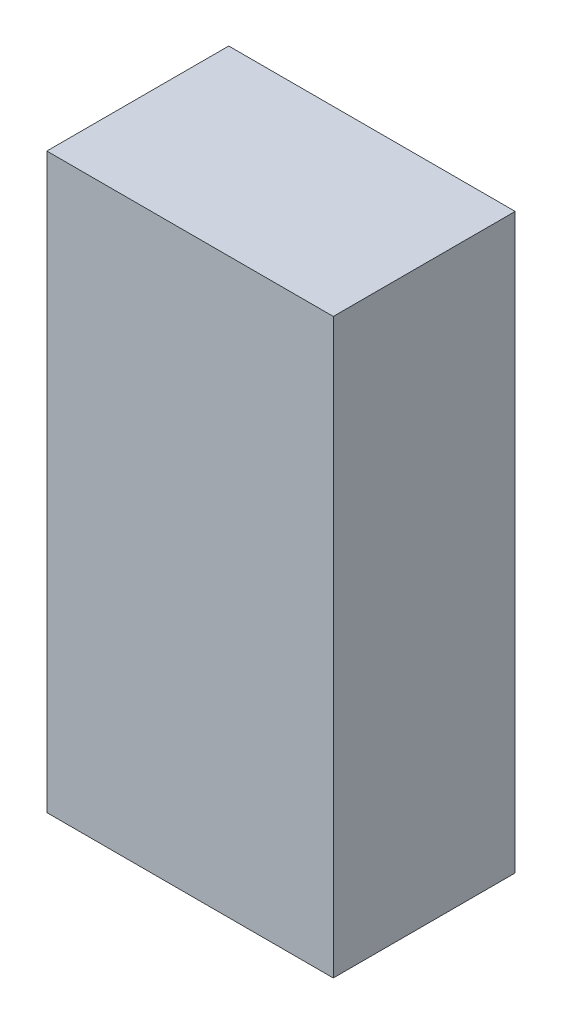
ISO-10303-21;
HEADER;
FILE_DESCRIPTION(('STEP AP214'),'2;1');
FILE_NAME('part.step','',(''),(''),'','','');
FILE_SCHEMA(('AUTOMOTIVE_DESIGN { 1 0 10303 214 1 1 1 1 }'));
ENDSEC;
DATA;
#1=APPLICATION_CONTEXT('core data for automotive mechanical design processes');
#2=APPLICATION_PROTOCOL_DEFINITION('international standard','automotive_design',2000,#1);
#3=PRODUCT_CONTEXT('',#1,'mechanical');
#4=PRODUCT('Part','Part','',(#3));
#5=PRODUCT_RELATED_PRODUCT_CATEGORY('part','',(#4));
#6=PRODUCT_DEFINITION_FORMATION('','',#4);
#7=PRODUCT_DEFINITION_CONTEXT('part definition',#1,'design');
#8=PRODUCT_DEFINITION('design','',#6,#7);
#9=PRODUCT_DEFINITION_SHAPE('','',#8);
#10=(LENGTH_UNIT() NAMED_UNIT(*) SI_UNIT(.MILLI.,.METRE.));
#11=(NAMED_UNIT(*) PLANE_ANGLE_UNIT() SI_UNIT($,.RADIAN.));
#12=(NAMED_UNIT(*) SI_UNIT($,.STERADIAN.) SOLID_ANGLE_UNIT());
#13=UNCERTAINTY_MEASURE_WITH_UNIT(LENGTH_MEASURE(1.E-05),#10,'distance_accuracy_value','');
#14=(GEOMETRIC_REPRESENTATION_CONTEXT(3) GLOBAL_UNCERTAINTY_ASSIGNED_CONTEXT((#13)) GLOBAL_UNIT_ASSIGNED_CONTEXT((#10,
#11,#12)) REPRESENTATION_CONTEXT('',''));
#15=CARTESIAN_POINT('',(0.,0.,0.));
#16=DIRECTION('',(0.,0.,1.));
#17=DIRECTION('',(1.,0.,0.));
#18=AXIS2_PLACEMENT_3D('',#15,#16,#17);
#19=CARTESIAN_POINT('',(-0.1999996,-0.3999992,0.254));
#20=DIRECTION('',(0.,0.,-1.));
#21=DIRECTION('',(0.,-1.,0.));
#22=AXIS2_PLACEMENT_3D('',#19,#20,#21);
#23=PLANE('',#22);
#24=DIRECTION('',(1.,0.,0.));
#25=VECTOR('',#24,1.);
#26=CARTESIAN_POINT('',(-0.1999996,-0.3999992,0.254));
#27=LINE('',#26,#25);
#28=CARTESIAN_POINT('',(-0.1999996,-0.3999992,0.254));
#29=VERTEX_POINT('',#28);
#30=CARTESIAN_POINT('',(0.1999996,-0.3999992,0.254));
#31=VERTEX_POINT('',#30);
#32=EDGE_CURVE('E80',#29,#31,#27,.T.);
#33=ORIENTED_EDGE('',*,*,#32,.T.);
#34=DIRECTION('',(0.,1.,0.));
#35=VECTOR('',#34,1.);
#36=CARTESIAN_POINT('',(0.1999996,-0.3999992,0.254));
#37=LINE('',#36,#35);
#38=CARTESIAN_POINT('',(0.1999996,0.40000174,0.254));
#39=VERTEX_POINT('',#38);
#40=EDGE_CURVE('E78',#31,#39,#37,.T.);
#41=ORIENTED_EDGE('',*,*,#40,.T.);
#42=DIRECTION('',(-1.,0.,0.));
#43=VECTOR('',#42,1.);
#44=CARTESIAN_POINT('',(0.1999996,0.40000174,0.254));
#45=LINE('',#44,#43);
#46=CARTESIAN_POINT('',(-0.1999996,0.40000174,0.254));
#47=VERTEX_POINT('',#46);
#48=EDGE_CURVE('E66',#39,#47,#45,.T.);
#49=ORIENTED_EDGE('',*,*,#48,.T.);
#50=DIRECTION('',(0.,-1.,0.));
#51=VECTOR('',#50,1.);
#52=CARTESIAN_POINT('',(-0.1999996,0.40000174,0.254));
#53=LINE('',#52,#51);
#54=EDGE_CURVE('E11',#47,#29,#53,.T.);
#55=ORIENTED_EDGE('',*,*,#54,.T.);
#56=EDGE_LOOP('',(#33,#41,#49,#55));
#57=FACE_BOUND('',#56,.T.);
#58=ADVANCED_FACE('F17',(#57),#23,.F.);
#59=CARTESIAN_POINT('',(-0.1999996,-0.3999992,0.));
#60=DIRECTION('',(0.,0.,-1.));
#61=DIRECTION('',(0.,-1.,0.));
#62=AXIS2_PLACEMENT_3D('',#59,#60,#61);
#63=PLANE('',#62);
#64=DIRECTION('',(1.,0.,0.));
#65=VECTOR('',#64,1.);
#66=CARTESIAN_POINT('',(-0.1999996,-0.3999992,0.));
#67=LINE('',#66,#65);
#68=CARTESIAN_POINT('',(-0.1999996,-0.3999992,0.));
#69=VERTEX_POINT('',#68);
#70=CARTESIAN_POINT('',(0.1999996,-0.3999992,0.));
#71=VERTEX_POINT('',#70);
#72=EDGE_CURVE('E101',#69,#71,#67,.T.);
#73=ORIENTED_EDGE('',*,*,#72,.F.);
#74=DIRECTION('',(0.,-1.,0.));
#75=VECTOR('',#74,1.);
#76=CARTESIAN_POINT('',(-0.1999996,0.40000174,0.));
#77=LINE('',#76,#75);
#78=CARTESIAN_POINT('',(-0.1999996,0.40000174,0.));
#79=VERTEX_POINT('',#78);
#80=EDGE_CURVE('E28',#79,#69,#77,.T.);
#81=ORIENTED_EDGE('',*,*,#80,.F.);
#82=DIRECTION('',(-1.,0.,0.));
#83=VECTOR('',#82,1.);
#84=CARTESIAN_POINT('',(0.1999996,0.40000174,0.));
#85=LINE('',#84,#83);
#86=CARTESIAN_POINT('',(0.1999996,0.40000174,0.));
#87=VERTEX_POINT('',#86);
#88=EDGE_CURVE('E85',#87,#79,#85,.T.);
#89=ORIENTED_EDGE('',*,*,#88,.F.);
#90=DIRECTION('',(0.,1.,0.));
#91=VECTOR('',#90,1.);
#92=CARTESIAN_POINT('',(0.1999996,-0.3999992,0.));
#93=LINE('',#92,#91);
#94=EDGE_CURVE('E88',#71,#87,#93,.T.);
#95=ORIENTED_EDGE('',*,*,#94,.F.);
#96=EDGE_LOOP('',(#73,#81,#89,#95));
#97=FACE_BOUND('',#96,.T.);
#98=ADVANCED_FACE('F121',(#97),#63,.T.);
#99=CARTESIAN_POINT('',(-0.1999996,0.40000174,0.));
#100=DIRECTION('',(1.,0.,0.));
#101=DIRECTION('',(0.,1.,0.));
#102=AXIS2_PLACEMENT_3D('',#99,#100,#101);
#103=PLANE('',#102);
#104=DIRECTION('',(0.,0.,1.));
#105=VECTOR('',#104,1.);
#106=CARTESIAN_POINT('',(-0.1999996,0.40000174,0.));
#107=LINE('',#106,#105);
#108=EDGE_CURVE('E73',#79,#47,#107,.T.);
#109=ORIENTED_EDGE('',*,*,#108,.F.);
#110=ORIENTED_EDGE('',*,*,#80,.T.);
#111=DIRECTION('',(0.,0.,1.));
#112=VECTOR('',#111,1.);
#113=CARTESIAN_POINT('',(-0.1999996,-0.3999992,0.));
#114=LINE('',#113,#112);
#115=EDGE_CURVE('E98',#69,#29,#114,.T.);
#116=ORIENTED_EDGE('',*,*,#115,.T.);
#117=ORIENTED_EDGE('',*,*,#54,.F.);
#118=EDGE_LOOP('',(#109,#110,#116,#117));
#119=FACE_BOUND('',#118,.T.);
#120=ADVANCED_FACE('F117',(#119),#103,.F.);
#121=CARTESIAN_POINT('',(0.1999996,0.40000174,0.));
#122=DIRECTION('',(0.,-1.,0.));
#123=DIRECTION('',(0.,0.,-1.));
#124=AXIS2_PLACEMENT_3D('',#121,#122,#123);
#125=PLANE('',#124);
#126=DIRECTION('',(0.,0.,1.));
#127=VECTOR('',#126,1.);
#128=CARTESIAN_POINT('',(0.1999996,0.40000174,0.));
#129=LINE('',#128,#127);
#130=EDGE_CURVE('E71',#87,#39,#129,.T.);
#131=ORIENTED_EDGE('',*,*,#130,.F.);
#132=ORIENTED_EDGE('',*,*,#88,.T.);
#133=ORIENTED_EDGE('',*,*,#108,.T.);
#134=ORIENTED_EDGE('',*,*,#48,.F.);
#135=EDGE_LOOP('',(#131,#132,#133,#134));
#136=FACE_BOUND('',#135,.T.);
#137=ADVANCED_FACE('F68',(#136),#125,.F.);
#138=CARTESIAN_POINT('',(0.1999996,-0.3999992,0.));
#139=DIRECTION('',(-1.,0.,0.));
#140=DIRECTION('',(0.,0.,1.));
#141=AXIS2_PLACEMENT_3D('',#138,#139,#140);
#142=PLANE('',#141);
#143=DIRECTION('',(0.,0.,1.));
#144=VECTOR('',#143,1.);
#145=CARTESIAN_POINT('',(0.1999996,-0.3999992,0.));
#146=LINE('',#145,#144);
#147=EDGE_CURVE('E21',#71,#31,#146,.T.);
#148=ORIENTED_EDGE('',*,*,#147,.F.);
#149=ORIENTED_EDGE('',*,*,#94,.T.);
#150=ORIENTED_EDGE('',*,*,#130,.T.);
#151=ORIENTED_EDGE('',*,*,#40,.F.);
#152=EDGE_LOOP('',(#148,#149,#150,#151));
#153=FACE_BOUND('',#152,.T.);
#154=ADVANCED_FACE('F87',(#153),#142,.F.);
#155=CARTESIAN_POINT('',(-0.1999996,-0.3999992,0.));
#156=DIRECTION('',(0.,1.,0.));
#157=DIRECTION('',(1.,0.,0.));
#158=AXIS2_PLACEMENT_3D('',#155,#156,#157);
#159=PLANE('',#158);
#160=ORIENTED_EDGE('',*,*,#115,.F.);
#161=ORIENTED_EDGE('',*,*,#72,.T.);
#162=ORIENTED_EDGE('',*,*,#147,.T.);
#163=ORIENTED_EDGE('',*,*,#32,.F.);
#164=EDGE_LOOP('',(#160,#161,#162,#163));
#165=FACE_BOUND('',#164,.T.);
#166=ADVANCED_FACE('F19',(#165),#159,.F.);
#167=CLOSED_SHELL('',(#58,#98,#120,#137,#154,#166));
#168=MANIFOLD_SOLID_BREP('B1',#167);
#169=ADVANCED_BREP_SHAPE_REPRESENTATION('',(#18,#168),#14);
#170=SHAPE_DEFINITION_REPRESENTATION(#9,#169);
ENDSEC;
END-ISO-10303-21;
